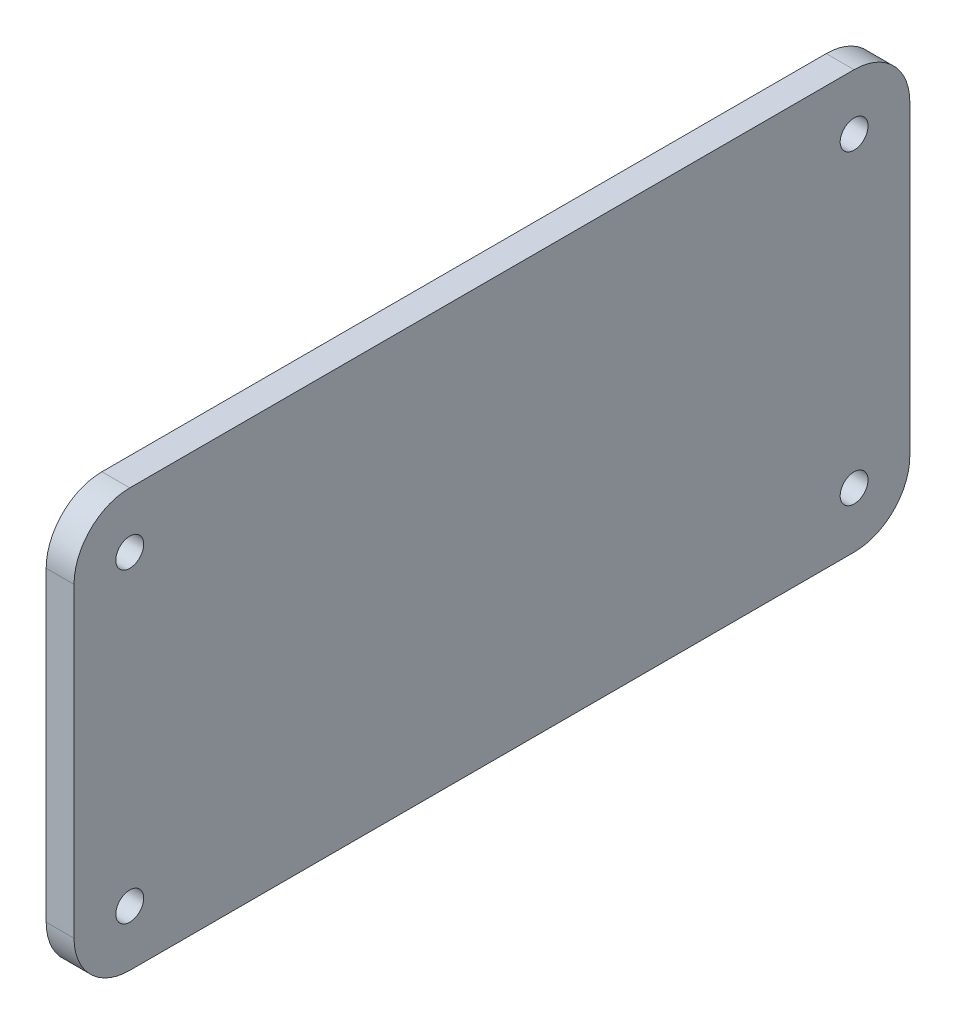
ISO-10303-21;
HEADER;
FILE_DESCRIPTION(('STEP AP214'),'2;1');
FILE_NAME('part.step','',(''),(''),'','','');
FILE_SCHEMA(('AUTOMOTIVE_DESIGN { 1 0 10303 214 1 1 1 1 }'));
ENDSEC;
DATA;
#1=APPLICATION_CONTEXT('core data for automotive mechanical design processes');
#2=APPLICATION_PROTOCOL_DEFINITION('international standard','automotive_design',2000,#1);
#3=PRODUCT_CONTEXT('',#1,'mechanical');
#4=PRODUCT('Part','Part','',(#3));
#5=PRODUCT_RELATED_PRODUCT_CATEGORY('part','',(#4));
#6=PRODUCT_DEFINITION_FORMATION('','',#4);
#7=PRODUCT_DEFINITION_CONTEXT('part definition',#1,'design');
#8=PRODUCT_DEFINITION('design','',#6,#7);
#9=PRODUCT_DEFINITION_SHAPE('','',#8);
#10=(LENGTH_UNIT() NAMED_UNIT(*) SI_UNIT(.MILLI.,.METRE.));
#11=(NAMED_UNIT(*) PLANE_ANGLE_UNIT() SI_UNIT($,.RADIAN.));
#12=(NAMED_UNIT(*) SI_UNIT($,.STERADIAN.) SOLID_ANGLE_UNIT());
#13=UNCERTAINTY_MEASURE_WITH_UNIT(LENGTH_MEASURE(1.E-05),#10,'distance_accuracy_value','');
#14=(GEOMETRIC_REPRESENTATION_CONTEXT(3) GLOBAL_UNCERTAINTY_ASSIGNED_CONTEXT((#13)) GLOBAL_UNIT_ASSIGNED_CONTEXT((#10,
#11,#12)) REPRESENTATION_CONTEXT('',''));
#15=CARTESIAN_POINT('',(0.,0.,0.));
#16=DIRECTION('',(0.,0.,1.));
#17=DIRECTION('',(1.,0.,0.));
#18=AXIS2_PLACEMENT_3D('',#15,#16,#17);
#19=CARTESIAN_POINT('',(5.,27.5,-65.));
#20=DIRECTION('',(1.,0.,0.));
#21=DIRECTION('',(0.,0.,-1.));
#22=AXIS2_PLACEMENT_3D('',#19,#20,#21);
#23=PLANE('',#22);
#24=CARTESIAN_POINT('',(5.,-27.5,-65.));
#25=DIRECTION('',(1.,0.,0.));
#26=DIRECTION('',(0.,0.,-1.));
#27=AXIS2_PLACEMENT_3D('',#24,#25,#26);
#28=CIRCLE('',#27,2.50000000000001);
#29=CARTESIAN_POINT('',(5.,-27.5,-67.5));
#30=VERTEX_POINT('',#29);
#31=EDGE_CURVE('E187',#30,#30,#28,.T.);
#32=ORIENTED_EDGE('',*,*,#31,.F.);
#33=EDGE_LOOP('',(#32));
#34=FACE_BOUND('',#33,.T.);
#35=CARTESIAN_POINT('',(5.,27.5,65.));
#36=DIRECTION('',(1.,0.,0.));
#37=DIRECTION('',(0.,0.,-1.));
#38=AXIS2_PLACEMENT_3D('',#35,#36,#37);
#39=CIRCLE('',#38,2.50000000000001);
#40=CARTESIAN_POINT('',(5.,27.5,62.5));
#41=VERTEX_POINT('',#40);
#42=EDGE_CURVE('E133',#41,#41,#39,.T.);
#43=ORIENTED_EDGE('',*,*,#42,.F.);
#44=EDGE_LOOP('',(#43));
#45=FACE_BOUND('',#44,.T.);
#46=CARTESIAN_POINT('',(5.,27.5,-65.));
#47=DIRECTION('',(1.,0.,0.));
#48=DIRECTION('',(0.,0.,-1.));
#49=AXIS2_PLACEMENT_3D('',#46,#47,#48);
#50=CIRCLE('',#49,10.);
#51=CARTESIAN_POINT('',(5.,27.4999999999999,-75.));
#52=VERTEX_POINT('',#51);
#53=CARTESIAN_POINT('',(5.,37.5,-64.9999999999999));
#54=VERTEX_POINT('',#53);
#55=EDGE_CURVE('E144',#52,#54,#50,.T.);
#56=ORIENTED_EDGE('',*,*,#55,.T.);
#57=DIRECTION('',(0.,0.,1.));
#58=VECTOR('',#57,1.);
#59=CARTESIAN_POINT('',(5.,37.5,64.9999999999999));
#60=LINE('',#59,#58);
#61=CARTESIAN_POINT('',(5.,37.5,64.9999999999999));
#62=VERTEX_POINT('',#61);
#63=EDGE_CURVE('E92',#54,#62,#60,.T.);
#64=ORIENTED_EDGE('',*,*,#63,.T.);
#65=CARTESIAN_POINT('',(5.,27.5,65.));
#66=DIRECTION('',(1.,0.,0.));
#67=DIRECTION('',(0.,0.,-1.));
#68=AXIS2_PLACEMENT_3D('',#65,#66,#67);
#69=CIRCLE('',#68,10.);
#70=CARTESIAN_POINT('',(5.,27.4999999999999,75.));
#71=VERTEX_POINT('',#70);
#72=EDGE_CURVE('E159',#62,#71,#69,.T.);
#73=ORIENTED_EDGE('',*,*,#72,.T.);
#74=DIRECTION('',(0.,-1.,0.));
#75=VECTOR('',#74,1.);
#76=CARTESIAN_POINT('',(5.,27.4999999999999,75.));
#77=LINE('',#76,#75);
#78=CARTESIAN_POINT('',(5.,-27.4999999999999,75.));
#79=VERTEX_POINT('',#78);
#80=EDGE_CURVE('E172',#71,#79,#77,.T.);
#81=ORIENTED_EDGE('',*,*,#80,.T.);
#82=CARTESIAN_POINT('',(5.,-27.5,65.));
#83=DIRECTION('',(1.,0.,0.));
#84=DIRECTION('',(0.,0.,-1.));
#85=AXIS2_PLACEMENT_3D('',#82,#83,#84);
#86=CIRCLE('',#85,10.);
#87=CARTESIAN_POINT('',(5.,-37.5,64.9999999999999));
#88=VERTEX_POINT('',#87);
#89=EDGE_CURVE('E111',#79,#88,#86,.T.);
#90=ORIENTED_EDGE('',*,*,#89,.T.);
#91=DIRECTION('',(0.,0.,-1.));
#92=VECTOR('',#91,1.);
#93=CARTESIAN_POINT('',(5.,-37.5,64.9999999999999));
#94=LINE('',#93,#92);
#95=CARTESIAN_POINT('',(5.,-37.5,-64.9999999999999));
#96=VERTEX_POINT('',#95);
#97=EDGE_CURVE('E105',#88,#96,#94,.T.);
#98=ORIENTED_EDGE('',*,*,#97,.T.);
#99=CARTESIAN_POINT('',(5.,-27.5,-65.));
#100=DIRECTION('',(1.,0.,0.));
#101=DIRECTION('',(0.,0.,1.));
#102=AXIS2_PLACEMENT_3D('',#99,#100,#101);
#103=CIRCLE('',#102,10.);
#104=CARTESIAN_POINT('',(5.,-27.4999999999999,-75.));
#105=VERTEX_POINT('',#104);
#106=EDGE_CURVE('E109',#96,#105,#103,.T.);
#107=ORIENTED_EDGE('',*,*,#106,.T.);
#108=DIRECTION('',(0.,1.,0.));
#109=VECTOR('',#108,1.);
#110=CARTESIAN_POINT('',(5.,27.4999999999999,-75.));
#111=LINE('',#110,#109);
#112=EDGE_CURVE('E49',#105,#52,#111,.T.);
#113=ORIENTED_EDGE('',*,*,#112,.T.);
#114=EDGE_LOOP('',(#56,#64,#73,#81,#90,#98,#107,#113));
#115=FACE_BOUND('',#114,.T.);
#116=CARTESIAN_POINT('',(5.,27.5,-65.));
#117=DIRECTION('',(1.,0.,0.));
#118=DIRECTION('',(0.,0.,-1.));
#119=AXIS2_PLACEMENT_3D('',#116,#117,#118);
#120=CIRCLE('',#119,2.50000000000001);
#121=CARTESIAN_POINT('',(5.,27.5,-67.5));
#122=VERTEX_POINT('',#121);
#123=EDGE_CURVE('E181',#122,#122,#120,.T.);
#124=ORIENTED_EDGE('',*,*,#123,.F.);
#125=EDGE_LOOP('',(#124));
#126=FACE_BOUND('',#125,.T.);
#127=CARTESIAN_POINT('',(5.,-27.5,65.));
#128=DIRECTION('',(1.,0.,0.));
#129=DIRECTION('',(0.,0.,-1.));
#130=AXIS2_PLACEMENT_3D('',#127,#128,#129);
#131=CIRCLE('',#130,2.50000000000001);
#132=CARTESIAN_POINT('',(5.,-27.5,62.5));
#133=VERTEX_POINT('',#132);
#134=EDGE_CURVE('E193',#133,#133,#131,.T.);
#135=ORIENTED_EDGE('',*,*,#134,.F.);
#136=EDGE_LOOP('',(#135));
#137=FACE_BOUND('',#136,.T.);
#138=ADVANCED_FACE('F32',(#34,#45,#115,#126,#137),#23,.T.);
#139=CARTESIAN_POINT('',(0.,27.5,-65.));
#140=DIRECTION('',(1.,0.,0.));
#141=DIRECTION('',(0.,0.,-1.));
#142=AXIS2_PLACEMENT_3D('',#139,#140,#141);
#143=PLANE('',#142);
#144=CARTESIAN_POINT('',(0.,-27.5,-65.));
#145=DIRECTION('',(1.,0.,0.));
#146=DIRECTION('',(0.,0.,-1.));
#147=AXIS2_PLACEMENT_3D('',#144,#145,#146);
#148=CIRCLE('',#147,2.50000000000001);
#149=CARTESIAN_POINT('',(0.,-27.5,-67.5));
#150=VERTEX_POINT('',#149);
#151=EDGE_CURVE('E190',#150,#150,#148,.T.);
#152=ORIENTED_EDGE('',*,*,#151,.T.);
#153=EDGE_LOOP('',(#152));
#154=FACE_BOUND('',#153,.T.);
#155=CARTESIAN_POINT('',(0.,27.5,65.));
#156=DIRECTION('',(1.,0.,0.));
#157=DIRECTION('',(0.,0.,-1.));
#158=AXIS2_PLACEMENT_3D('',#155,#156,#157);
#159=CIRCLE('',#158,2.50000000000001);
#160=CARTESIAN_POINT('',(0.,27.5,62.5));
#161=VERTEX_POINT('',#160);
#162=EDGE_CURVE('E178',#161,#161,#159,.T.);
#163=ORIENTED_EDGE('',*,*,#162,.T.);
#164=EDGE_LOOP('',(#163));
#165=FACE_BOUND('',#164,.T.);
#166=CARTESIAN_POINT('',(0.,27.5,-65.));
#167=DIRECTION('',(1.,0.,0.));
#168=DIRECTION('',(0.,0.,-1.));
#169=AXIS2_PLACEMENT_3D('',#166,#167,#168);
#170=CIRCLE('',#169,10.);
#171=CARTESIAN_POINT('',(0.,27.4999999999999,-75.));
#172=VERTEX_POINT('',#171);
#173=CARTESIAN_POINT('',(0.,37.5,-64.9999999999999));
#174=VERTEX_POINT('',#173);
#175=EDGE_CURVE('E129',#172,#174,#170,.T.);
#176=ORIENTED_EDGE('',*,*,#175,.F.);
#177=DIRECTION('',(0.,1.,0.));
#178=VECTOR('',#177,1.);
#179=CARTESIAN_POINT('',(0.,27.4999999999999,-75.));
#180=LINE('',#179,#178);
#181=CARTESIAN_POINT('',(0.,-27.4999999999999,-75.));
#182=VERTEX_POINT('',#181);
#183=EDGE_CURVE('E84',#182,#172,#180,.T.);
#184=ORIENTED_EDGE('',*,*,#183,.F.);
#185=CARTESIAN_POINT('',(0.,-27.5,-65.));
#186=DIRECTION('',(1.,0.,0.));
#187=DIRECTION('',(0.,0.,1.));
#188=AXIS2_PLACEMENT_3D('',#185,#186,#187);
#189=CIRCLE('',#188,10.);
#190=CARTESIAN_POINT('',(0.,-37.5,-64.9999999999999));
#191=VERTEX_POINT('',#190);
#192=EDGE_CURVE('E78',#191,#182,#189,.T.);
#193=ORIENTED_EDGE('',*,*,#192,.F.);
#194=DIRECTION('',(0.,0.,-1.));
#195=VECTOR('',#194,1.);
#196=CARTESIAN_POINT('',(0.,-37.5,64.9999999999999));
#197=LINE('',#196,#195);
#198=CARTESIAN_POINT('',(0.,-37.5,64.9999999999999));
#199=VERTEX_POINT('',#198);
#200=EDGE_CURVE('E119',#199,#191,#197,.T.);
#201=ORIENTED_EDGE('',*,*,#200,.F.);
#202=CARTESIAN_POINT('',(0.,-27.5,65.));
#203=DIRECTION('',(1.,0.,0.));
#204=DIRECTION('',(0.,0.,-1.));
#205=AXIS2_PLACEMENT_3D('',#202,#203,#204);
#206=CIRCLE('',#205,10.);
#207=CARTESIAN_POINT('',(0.,-27.4999999999999,75.));
#208=VERTEX_POINT('',#207);
#209=EDGE_CURVE('E139',#208,#199,#206,.T.);
#210=ORIENTED_EDGE('',*,*,#209,.F.);
#211=DIRECTION('',(0.,-1.,0.));
#212=VECTOR('',#211,1.);
#213=CARTESIAN_POINT('',(0.,27.4999999999999,75.));
#214=LINE('',#213,#212);
#215=CARTESIAN_POINT('',(0.,27.4999999999999,75.));
#216=VERTEX_POINT('',#215);
#217=EDGE_CURVE('E137',#216,#208,#214,.T.);
#218=ORIENTED_EDGE('',*,*,#217,.F.);
#219=CARTESIAN_POINT('',(0.,27.5,65.));
#220=DIRECTION('',(1.,0.,0.));
#221=DIRECTION('',(0.,0.,-1.));
#222=AXIS2_PLACEMENT_3D('',#219,#220,#221);
#223=CIRCLE('',#222,10.);
#224=CARTESIAN_POINT('',(0.,37.5,64.9999999999999));
#225=VERTEX_POINT('',#224);
#226=EDGE_CURVE('E135',#225,#216,#223,.T.);
#227=ORIENTED_EDGE('',*,*,#226,.F.);
#228=DIRECTION('',(0.,0.,1.));
#229=VECTOR('',#228,1.);
#230=CARTESIAN_POINT('',(0.,37.5,64.9999999999999));
#231=LINE('',#230,#229);
#232=EDGE_CURVE('E132',#174,#225,#231,.T.);
#233=ORIENTED_EDGE('',*,*,#232,.F.);
#234=EDGE_LOOP('',(#176,#184,#193,#201,#210,#218,#227,#233));
#235=FACE_BOUND('',#234,.T.);
#236=CARTESIAN_POINT('',(0.,27.5,-65.));
#237=DIRECTION('',(1.,0.,0.));
#238=DIRECTION('',(0.,0.,-1.));
#239=AXIS2_PLACEMENT_3D('',#236,#237,#238);
#240=CIRCLE('',#239,2.50000000000001);
#241=CARTESIAN_POINT('',(0.,27.5,-67.5));
#242=VERTEX_POINT('',#241);
#243=EDGE_CURVE('E184',#242,#242,#240,.T.);
#244=ORIENTED_EDGE('',*,*,#243,.T.);
#245=EDGE_LOOP('',(#244));
#246=FACE_BOUND('',#245,.T.);
#247=CARTESIAN_POINT('',(0.,-27.5,65.));
#248=DIRECTION('',(1.,0.,0.));
#249=DIRECTION('',(0.,0.,-1.));
#250=AXIS2_PLACEMENT_3D('',#247,#248,#249);
#251=CIRCLE('',#250,2.50000000000001);
#252=CARTESIAN_POINT('',(0.,-27.5,62.5));
#253=VERTEX_POINT('',#252);
#254=EDGE_CURVE('E196',#253,#253,#251,.T.);
#255=ORIENTED_EDGE('',*,*,#254,.T.);
#256=EDGE_LOOP('',(#255));
#257=FACE_BOUND('',#256,.T.);
#258=ADVANCED_FACE('F163',(#154,#165,#235,#246,#257),#143,.F.);
#259=CARTESIAN_POINT('',(5.,27.5,-65.));
#260=DIRECTION('',(-1.,0.,0.));
#261=DIRECTION('',(0.,0.,1.));
#262=AXIS2_PLACEMENT_3D('',#259,#260,#261);
#263=CYLINDRICAL_SURFACE('',#262,10.);
#264=ORIENTED_EDGE('',*,*,#175,.T.);
#265=DIRECTION('',(-1.,0.,0.));
#266=VECTOR('',#265,1.);
#267=CARTESIAN_POINT('',(5.,37.5,-64.9999999999999));
#268=LINE('',#267,#266);
#269=EDGE_CURVE('E11',#54,#174,#268,.T.);
#270=ORIENTED_EDGE('',*,*,#269,.F.);
#271=ORIENTED_EDGE('',*,*,#55,.F.);
#272=DIRECTION('',(-1.,0.,0.));
#273=VECTOR('',#272,1.);
#274=CARTESIAN_POINT('',(5.,27.4999999999999,-75.));
#275=LINE('',#274,#273);
#276=EDGE_CURVE('E125',#52,#172,#275,.T.);
#277=ORIENTED_EDGE('',*,*,#276,.T.);
#278=EDGE_LOOP('',(#264,#270,#271,#277));
#279=FACE_BOUND('',#278,.T.);
#280=ADVANCED_FACE('F34',(#279),#263,.T.);
#281=CARTESIAN_POINT('',(5.,37.5,64.9999999999999));
#282=DIRECTION('',(0.,-1.,0.));
#283=DIRECTION('',(0.,0.,-1.));
#284=AXIS2_PLACEMENT_3D('',#281,#282,#283);
#285=PLANE('',#284);
#286=ORIENTED_EDGE('',*,*,#232,.T.);
#287=DIRECTION('',(-1.,0.,0.));
#288=VECTOR('',#287,1.);
#289=CARTESIAN_POINT('',(5.,37.5,64.9999999999999));
#290=LINE('',#289,#288);
#291=EDGE_CURVE('E41',#62,#225,#290,.T.);
#292=ORIENTED_EDGE('',*,*,#291,.F.);
#293=ORIENTED_EDGE('',*,*,#63,.F.);
#294=ORIENTED_EDGE('',*,*,#269,.T.);
#295=EDGE_LOOP('',(#286,#292,#293,#294));
#296=FACE_BOUND('',#295,.T.);
#297=ADVANCED_FACE('F231',(#296),#285,.F.);
#298=CARTESIAN_POINT('',(5.,27.5,65.));
#299=DIRECTION('',(-1.,0.,0.));
#300=DIRECTION('',(0.,0.,1.));
#301=AXIS2_PLACEMENT_3D('',#298,#299,#300);
#302=CYLINDRICAL_SURFACE('',#301,10.);
#303=ORIENTED_EDGE('',*,*,#226,.T.);
#304=DIRECTION('',(-1.,0.,0.));
#305=VECTOR('',#304,1.);
#306=CARTESIAN_POINT('',(5.,27.4999999999999,75.));
#307=LINE('',#306,#305);
#308=EDGE_CURVE('E151',#71,#216,#307,.T.);
#309=ORIENTED_EDGE('',*,*,#308,.F.);
#310=ORIENTED_EDGE('',*,*,#72,.F.);
#311=ORIENTED_EDGE('',*,*,#291,.T.);
#312=EDGE_LOOP('',(#303,#309,#310,#311));
#313=FACE_BOUND('',#312,.T.);
#314=ADVANCED_FACE('F157',(#313),#302,.T.);
#315=CARTESIAN_POINT('',(5.,27.4999999999999,75.));
#316=DIRECTION('',(0.,0.,-1.));
#317=DIRECTION('',(-1.,0.,0.));
#318=AXIS2_PLACEMENT_3D('',#315,#316,#317);
#319=PLANE('',#318);
#320=ORIENTED_EDGE('',*,*,#217,.T.);
#321=DIRECTION('',(-1.,0.,0.));
#322=VECTOR('',#321,1.);
#323=CARTESIAN_POINT('',(5.,-27.4999999999999,75.));
#324=LINE('',#323,#322);
#325=EDGE_CURVE('E148',#79,#208,#324,.T.);
#326=ORIENTED_EDGE('',*,*,#325,.F.);
#327=ORIENTED_EDGE('',*,*,#80,.F.);
#328=ORIENTED_EDGE('',*,*,#308,.T.);
#329=EDGE_LOOP('',(#320,#326,#327,#328));
#330=FACE_BOUND('',#329,.T.);
#331=ADVANCED_FACE('F168',(#330),#319,.F.);
#332=CARTESIAN_POINT('',(5.,-27.5,65.));
#333=DIRECTION('',(-1.,0.,0.));
#334=DIRECTION('',(0.,0.,1.));
#335=AXIS2_PLACEMENT_3D('',#332,#333,#334);
#336=CYLINDRICAL_SURFACE('',#335,10.);
#337=ORIENTED_EDGE('',*,*,#209,.T.);
#338=DIRECTION('',(-1.,0.,0.));
#339=VECTOR('',#338,1.);
#340=CARTESIAN_POINT('',(5.,-37.5,64.9999999999999));
#341=LINE('',#340,#339);
#342=EDGE_CURVE('E120',#88,#199,#341,.T.);
#343=ORIENTED_EDGE('',*,*,#342,.F.);
#344=ORIENTED_EDGE('',*,*,#89,.F.);
#345=ORIENTED_EDGE('',*,*,#325,.T.);
#346=EDGE_LOOP('',(#337,#343,#344,#345));
#347=FACE_BOUND('',#346,.T.);
#348=ADVANCED_FACE('F171',(#347),#336,.T.);
#349=CARTESIAN_POINT('',(5.,-37.5,64.9999999999999));
#350=DIRECTION('',(0.,1.,0.));
#351=DIRECTION('',(0.,0.,1.));
#352=AXIS2_PLACEMENT_3D('',#349,#350,#351);
#353=PLANE('',#352);
#354=ORIENTED_EDGE('',*,*,#200,.T.);
#355=DIRECTION('',(-1.,0.,0.));
#356=VECTOR('',#355,1.);
#357=CARTESIAN_POINT('',(5.,-37.5,-64.9999999999999));
#358=LINE('',#357,#356);
#359=EDGE_CURVE('E116',#96,#191,#358,.T.);
#360=ORIENTED_EDGE('',*,*,#359,.F.);
#361=ORIENTED_EDGE('',*,*,#97,.F.);
#362=ORIENTED_EDGE('',*,*,#342,.T.);
#363=EDGE_LOOP('',(#354,#360,#361,#362));
#364=FACE_BOUND('',#363,.T.);
#365=ADVANCED_FACE('F117',(#364),#353,.F.);
#366=CARTESIAN_POINT('',(5.,-27.5,-65.));
#367=DIRECTION('',(-1.,0.,0.));
#368=DIRECTION('',(0.,0.,1.));
#369=AXIS2_PLACEMENT_3D('',#366,#367,#368);
#370=CYLINDRICAL_SURFACE('',#369,10.);
#371=ORIENTED_EDGE('',*,*,#192,.T.);
#372=DIRECTION('',(-1.,0.,0.));
#373=VECTOR('',#372,1.);
#374=CARTESIAN_POINT('',(5.,-27.4999999999999,-75.));
#375=LINE('',#374,#373);
#376=EDGE_CURVE('E121',#105,#182,#375,.T.);
#377=ORIENTED_EDGE('',*,*,#376,.F.);
#378=ORIENTED_EDGE('',*,*,#106,.F.);
#379=ORIENTED_EDGE('',*,*,#359,.T.);
#380=EDGE_LOOP('',(#371,#377,#378,#379));
#381=FACE_BOUND('',#380,.T.);
#382=ADVANCED_FACE('F123',(#381),#370,.T.);
#383=CARTESIAN_POINT('',(5.,27.4999999999999,-75.));
#384=DIRECTION('',(0.,0.,1.));
#385=DIRECTION('',(1.,0.,0.));
#386=AXIS2_PLACEMENT_3D('',#383,#384,#385);
#387=PLANE('',#386);
#388=ORIENTED_EDGE('',*,*,#183,.T.);
#389=ORIENTED_EDGE('',*,*,#276,.F.);
#390=ORIENTED_EDGE('',*,*,#112,.F.);
#391=ORIENTED_EDGE('',*,*,#376,.T.);
#392=EDGE_LOOP('',(#388,#389,#390,#391));
#393=FACE_BOUND('',#392,.T.);
#394=ADVANCED_FACE('F219',(#393),#387,.F.);
#395=CARTESIAN_POINT('',(5.,27.5,65.));
#396=DIRECTION('',(-1.,0.,0.));
#397=DIRECTION('',(0.,0.,1.));
#398=AXIS2_PLACEMENT_3D('',#395,#396,#397);
#399=CYLINDRICAL_SURFACE('',#398,2.50000000000001);
#400=ORIENTED_EDGE('',*,*,#42,.T.);
#401=EDGE_LOOP('',(#400));
#402=FACE_BOUND('',#401,.T.);
#403=ORIENTED_EDGE('',*,*,#162,.F.);
#404=EDGE_LOOP('',(#403));
#405=FACE_BOUND('',#404,.T.);
#406=ADVANCED_FACE('F216',(#402,#405),#399,.F.);
#407=CARTESIAN_POINT('',(5.,27.5,-65.));
#408=DIRECTION('',(-1.,0.,0.));
#409=DIRECTION('',(0.,0.,1.));
#410=AXIS2_PLACEMENT_3D('',#407,#408,#409);
#411=CYLINDRICAL_SURFACE('',#410,2.50000000000001);
#412=ORIENTED_EDGE('',*,*,#123,.T.);
#413=EDGE_LOOP('',(#412));
#414=FACE_BOUND('',#413,.T.);
#415=ORIENTED_EDGE('',*,*,#243,.F.);
#416=EDGE_LOOP('',(#415));
#417=FACE_BOUND('',#416,.T.);
#418=ADVANCED_FACE('F295',(#414,#417),#411,.F.);
#419=CARTESIAN_POINT('',(5.,-27.5,-65.));
#420=DIRECTION('',(-1.,0.,0.));
#421=DIRECTION('',(0.,0.,1.));
#422=AXIS2_PLACEMENT_3D('',#419,#420,#421);
#423=CYLINDRICAL_SURFACE('',#422,2.50000000000001);
#424=ORIENTED_EDGE('',*,*,#31,.T.);
#425=EDGE_LOOP('',(#424));
#426=FACE_BOUND('',#425,.T.);
#427=ORIENTED_EDGE('',*,*,#151,.F.);
#428=EDGE_LOOP('',(#427));
#429=FACE_BOUND('',#428,.T.);
#430=ADVANCED_FACE('F303',(#426,#429),#423,.F.);
#431=CARTESIAN_POINT('',(5.,-27.5,65.));
#432=DIRECTION('',(-1.,0.,0.));
#433=DIRECTION('',(0.,0.,1.));
#434=AXIS2_PLACEMENT_3D('',#431,#432,#433);
#435=CYLINDRICAL_SURFACE('',#434,2.50000000000001);
#436=ORIENTED_EDGE('',*,*,#134,.T.);
#437=EDGE_LOOP('',(#436));
#438=FACE_BOUND('',#437,.T.);
#439=ORIENTED_EDGE('',*,*,#254,.F.);
#440=EDGE_LOOP('',(#439));
#441=FACE_BOUND('',#440,.T.);
#442=ADVANCED_FACE('F202',(#438,#441),#435,.F.);
#443=CLOSED_SHELL('',(#138,#258,#280,#297,#314,#331,#348,#365,#382,#394,#406,#418,#430,#442));
#444=MANIFOLD_SOLID_BREP('B2',#443);
#445=ADVANCED_BREP_SHAPE_REPRESENTATION('',(#18,#444),#14);
#446=SHAPE_DEFINITION_REPRESENTATION(#9,#445);
ENDSEC;
END-ISO-10303-21;
